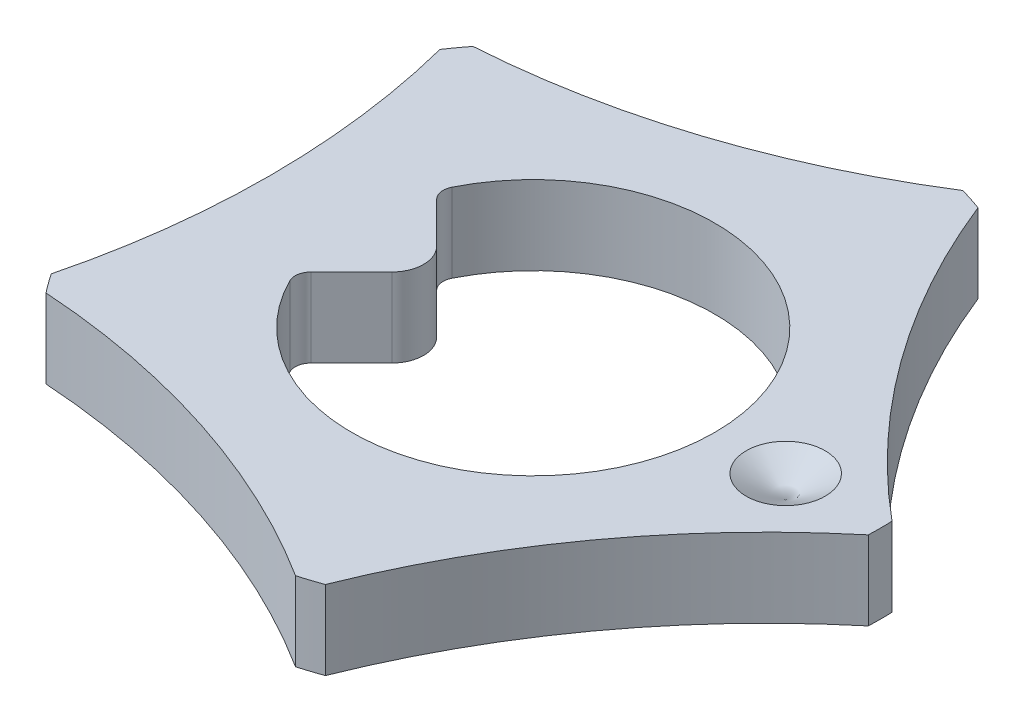
ISO-10303-21;
HEADER;
FILE_DESCRIPTION(('STEP AP214'),'2;1');
FILE_NAME('part.step','',(''),(''),'','','');
FILE_SCHEMA(('AUTOMOTIVE_DESIGN { 1 0 10303 214 1 1 1 1 }'));
ENDSEC;
DATA;
#1=APPLICATION_CONTEXT('core data for automotive mechanical design processes');
#2=APPLICATION_PROTOCOL_DEFINITION('international standard','automotive_design',2000,#1);
#3=PRODUCT_CONTEXT('',#1,'mechanical');
#4=PRODUCT('Part','Part','',(#3));
#5=PRODUCT_RELATED_PRODUCT_CATEGORY('part','',(#4));
#6=PRODUCT_DEFINITION_FORMATION('','',#4);
#7=PRODUCT_DEFINITION_CONTEXT('part definition',#1,'design');
#8=PRODUCT_DEFINITION('design','',#6,#7);
#9=PRODUCT_DEFINITION_SHAPE('','',#8);
#10=(LENGTH_UNIT() NAMED_UNIT(*) SI_UNIT(.MILLI.,.METRE.));
#11=(NAMED_UNIT(*) PLANE_ANGLE_UNIT() SI_UNIT($,.RADIAN.));
#12=(NAMED_UNIT(*) SI_UNIT($,.STERADIAN.) SOLID_ANGLE_UNIT());
#13=UNCERTAINTY_MEASURE_WITH_UNIT(LENGTH_MEASURE(1.E-05),#10,'distance_accuracy_value','');
#14=(GEOMETRIC_REPRESENTATION_CONTEXT(3) GLOBAL_UNCERTAINTY_ASSIGNED_CONTEXT((#13)) GLOBAL_UNIT_ASSIGNED_CONTEXT((#10,
#11,#12)) REPRESENTATION_CONTEXT('',''));
#15=CARTESIAN_POINT('',(0.,0.,0.));
#16=DIRECTION('',(0.,0.,1.));
#17=DIRECTION('',(1.,0.,0.));
#18=AXIS2_PLACEMENT_3D('',#15,#16,#17);
#19=CARTESIAN_POINT('',(0.,0.5,0.));
#20=DIRECTION('',(0.,-1.,0.));
#21=DIRECTION('',(0.,0.,-1.));
#22=AXIS2_PLACEMENT_3D('',#19,#20,#21);
#23=CYLINDRICAL_SURFACE('',#22,2.2);
#24=DIRECTION('',(0.,1.,0.));
#25=VECTOR('',#24,1.);
#26=CARTESIAN_POINT('',(0.750757798918163,0.,2.0679368286685));
#27=LINE('',#26,#25);
#28=CARTESIAN_POINT('',(0.750757798918164,0.,2.06793682866851));
#29=VERTEX_POINT('',#28);
#30=CARTESIAN_POINT('',(0.750757798918163,0.5,2.0679368286685));
#31=VERTEX_POINT('',#30);
#32=EDGE_CURVE('E308',#29,#31,#27,.T.);
#33=ORIENTED_EDGE('',*,*,#32,.T.);
#34=CARTESIAN_POINT('',(0.,0.5,0.));
#35=DIRECTION('',(0.,1.,0.));
#36=DIRECTION('',(0.,0.,1.));
#37=AXIS2_PLACEMENT_3D('',#34,#35,#36);
#38=CIRCLE('',#37,2.2);
#39=CARTESIAN_POINT('',(0.608126952579492,0.5,2.11428039993431));
#40=VERTEX_POINT('',#39);
#41=EDGE_CURVE('E227',#40,#31,#38,.T.);
#42=ORIENTED_EDGE('',*,*,#41,.F.);
#43=DIRECTION('',(0.,1.,0.));
#44=VECTOR('',#43,1.);
#45=CARTESIAN_POINT('',(0.608126952579492,0.,2.11428039993431));
#46=LINE('',#45,#44);
#47=CARTESIAN_POINT('',(0.608126952579492,0.,2.11428039993431));
#48=VERTEX_POINT('',#47);
#49=EDGE_CURVE('E310',#48,#40,#46,.T.);
#50=ORIENTED_EDGE('',*,*,#49,.F.);
#51=CARTESIAN_POINT('',(0.,0.,0.));
#52=DIRECTION('',(0.,1.,0.));
#53=DIRECTION('',(0.,0.,1.));
#54=AXIS2_PLACEMENT_3D('',#51,#52,#53);
#55=CIRCLE('',#54,2.2);
#56=EDGE_CURVE('E234',#48,#29,#55,.T.);
#57=ORIENTED_EDGE('',*,*,#56,.T.);
#58=EDGE_LOOP('',(#33,#42,#50,#57));
#59=FACE_BOUND('',#58,.T.);
#60=ADVANCED_FACE('F52',(#59),#23,.T.);
#61=DIRECTION('',(0.,1.,0.));
#62=VECTOR('',#61,1.);
#63=CARTESIAN_POINT('',(2.19872171471716,0.,0.0749854734681207));
#64=LINE('',#63,#62);
#65=CARTESIAN_POINT('',(2.19872171471716,0.,0.0749854734681207));
#66=VERTEX_POINT('',#65);
#67=CARTESIAN_POINT('',(2.19872171471716,0.5,0.0749854734681207));
#68=VERTEX_POINT('',#67);
#69=EDGE_CURVE('E306',#66,#68,#64,.T.);
#70=ORIENTED_EDGE('',*,*,#69,.F.);
#71=CARTESIAN_POINT('',(2.19872171471716,0.,-0.074985473468122));
#72=VERTEX_POINT('',#71);
#73=EDGE_CURVE('E237',#66,#72,#55,.T.);
#74=ORIENTED_EDGE('',*,*,#73,.T.);
#75=DIRECTION('',(0.,1.,0.));
#76=VECTOR('',#75,1.);
#77=CARTESIAN_POINT('',(2.19872171471716,0.,-0.0749854734681233));
#78=LINE('',#77,#76);
#79=CARTESIAN_POINT('',(2.19872171471716,0.5,-0.0749854734681233));
#80=VERTEX_POINT('',#79);
#81=EDGE_CURVE('E232',#72,#80,#78,.T.);
#82=ORIENTED_EDGE('',*,*,#81,.T.);
#83=EDGE_CURVE('E224',#68,#80,#38,.T.);
#84=ORIENTED_EDGE('',*,*,#83,.F.);
#85=EDGE_LOOP('',(#70,#74,#82,#84));
#86=FACE_BOUND('',#85,.T.);
#87=ADVANCED_FACE('F177',(#86),#23,.T.);
#88=DIRECTION('',(0.,1.,0.));
#89=VECTOR('',#88,1.);
#90=CARTESIAN_POINT('',(-1.73472787766668,0.,1.35304072017293));
#91=LINE('',#90,#89);
#92=CARTESIAN_POINT('',(-1.73472787766668,0.,1.35304072017293));
#93=VERTEX_POINT('',#92);
#94=CARTESIAN_POINT('',(-1.73472787766668,0.5,1.35304072017293));
#95=VERTEX_POINT('',#94);
#96=EDGE_CURVE('E312',#93,#95,#91,.T.);
#97=ORIENTED_EDGE('',*,*,#96,.T.);
#98=CARTESIAN_POINT('',(-1.82287858854814,0.5,1.231711675439));
#99=VERTEX_POINT('',#98);
#100=EDGE_CURVE('E228',#99,#95,#38,.T.);
#101=ORIENTED_EDGE('',*,*,#100,.F.);
#102=DIRECTION('',(0.,1.,0.));
#103=VECTOR('',#102,1.);
#104=CARTESIAN_POINT('',(-1.82287858854814,0.,1.231711675439));
#105=LINE('',#104,#103);
#106=CARTESIAN_POINT('',(-1.82287858854814,0.,1.231711675439));
#107=VERTEX_POINT('',#106);
#108=EDGE_CURVE('E315',#107,#99,#105,.T.);
#109=ORIENTED_EDGE('',*,*,#108,.F.);
#110=EDGE_CURVE('E238',#107,#93,#55,.T.);
#111=ORIENTED_EDGE('',*,*,#110,.T.);
#112=EDGE_LOOP('',(#97,#101,#109,#111));
#113=FACE_BOUND('',#112,.T.);
#114=ADVANCED_FACE('F184',(#113),#23,.T.);
#115=DIRECTION('',(0.,1.,0.));
#116=VECTOR('',#115,1.);
#117=CARTESIAN_POINT('',(-1.82287858854814,0.,-1.231711675439));
#118=LINE('',#117,#116);
#119=CARTESIAN_POINT('',(-1.82287858854814,0.,-1.231711675439));
#120=VERTEX_POINT('',#119);
#121=CARTESIAN_POINT('',(-1.82287858854814,0.5,-1.231711675439));
#122=VERTEX_POINT('',#121);
#123=EDGE_CURVE('E317',#120,#122,#118,.T.);
#124=ORIENTED_EDGE('',*,*,#123,.T.);
#125=CARTESIAN_POINT('',(-1.73472787766668,0.5,-1.35304072017293));
#126=VERTEX_POINT('',#125);
#127=EDGE_CURVE('E225',#126,#122,#38,.T.);
#128=ORIENTED_EDGE('',*,*,#127,.F.);
#129=DIRECTION('',(0.,1.,0.));
#130=VECTOR('',#129,1.);
#131=CARTESIAN_POINT('',(-1.73472787766668,0.,-1.35304072017293));
#132=LINE('',#131,#130);
#133=CARTESIAN_POINT('',(-1.73472787766668,0.,-1.35304072017293));
#134=VERTEX_POINT('',#133);
#135=EDGE_CURVE('E212',#134,#126,#132,.T.);
#136=ORIENTED_EDGE('',*,*,#135,.F.);
#137=EDGE_CURVE('E337',#134,#120,#55,.T.);
#138=ORIENTED_EDGE('',*,*,#137,.T.);
#139=EDGE_LOOP('',(#124,#128,#136,#138));
#140=FACE_BOUND('',#139,.T.);
#141=ADVANCED_FACE('F191',(#140),#23,.T.);
#142=DIRECTION('',(0.,1.,0.));
#143=VECTOR('',#142,1.);
#144=CARTESIAN_POINT('',(0.608126952579491,0.,-2.11428039993431));
#145=LINE('',#144,#143);
#146=CARTESIAN_POINT('',(0.608126952579491,0.,-2.11428039993431));
#147=VERTEX_POINT('',#146);
#148=CARTESIAN_POINT('',(0.608126952579491,0.5,-2.11428039993431));
#149=VERTEX_POINT('',#148);
#150=EDGE_CURVE('E204',#147,#149,#145,.T.);
#151=ORIENTED_EDGE('',*,*,#150,.T.);
#152=CARTESIAN_POINT('',(0.750757798918162,0.5,-2.06793682866851));
#153=VERTEX_POINT('',#152);
#154=EDGE_CURVE('E207',#153,#149,#38,.T.);
#155=ORIENTED_EDGE('',*,*,#154,.F.);
#156=DIRECTION('',(0.,1.,0.));
#157=VECTOR('',#156,1.);
#158=CARTESIAN_POINT('',(0.750757798918162,0.,-2.06793682866851));
#159=LINE('',#158,#157);
#160=CARTESIAN_POINT('',(0.750757798918162,0.,-2.06793682866851));
#161=VERTEX_POINT('',#160);
#162=EDGE_CURVE('E213',#161,#153,#159,.T.);
#163=ORIENTED_EDGE('',*,*,#162,.F.);
#164=EDGE_CURVE('E209',#161,#147,#55,.T.);
#165=ORIENTED_EDGE('',*,*,#164,.T.);
#166=EDGE_LOOP('',(#151,#155,#163,#165));
#167=FACE_BOUND('',#166,.T.);
#168=ADVANCED_FACE('F180',(#167),#23,.T.);
#169=CARTESIAN_POINT('',(0.,0.5,0.));
#170=DIRECTION('',(0.,1.,0.));
#171=DIRECTION('',(0.,0.,1.));
#172=AXIS2_PLACEMENT_3D('',#169,#170,#171);
#173=PLANE('',#172);
#174=CARTESIAN_POINT('',(1.6,0.5,0.));
#175=DIRECTION('',(0.,1.,0.));
#176=DIRECTION('',(0.,0.,1.));
#177=AXIS2_PLACEMENT_3D('',#174,#175,#176);
#178=CIRCLE('',#177,0.25);
#179=CARTESIAN_POINT('',(1.6,0.5,0.25));
#180=VERTEX_POINT('',#179);
#181=EDGE_CURVE('E513',#180,#180,#178,.T.);
#182=ORIENTED_EDGE('',*,*,#181,.F.);
#183=EDGE_LOOP('',(#182));
#184=FACE_BOUND('',#183,.T.);
#185=DIRECTION('',(-0.707106781186548,0.,0.707106781186547));
#186=VECTOR('',#185,1.);
#187=CARTESIAN_POINT('',(-0.612,0.5,0.));
#188=LINE('',#187,#186);
#189=CARTESIAN_POINT('',(-0.75342135623731,0.5,0.14142135623731));
#190=VERTEX_POINT('',#189);
#191=CARTESIAN_POINT('',(-1.01019381920649,0.5,0.398193819206485));
#192=VERTEX_POINT('',#191);
#193=EDGE_CURVE('E279',#190,#192,#188,.T.);
#194=ORIENTED_EDGE('',*,*,#193,.F.);
#195=CARTESIAN_POINT('',(-0.894842712474619,0.5,0.));
#196=DIRECTION('',(0.,1.,0.));
#197=DIRECTION('',(0.,0.,1.));
#198=AXIS2_PLACEMENT_3D('',#195,#196,#197);
#199=CIRCLE('',#198,0.2);
#200=CARTESIAN_POINT('',(-0.75342135623731,0.5,-0.14142135623731));
#201=VERTEX_POINT('',#200);
#202=EDGE_CURVE('E241',#190,#201,#199,.T.);
#203=ORIENTED_EDGE('',*,*,#202,.T.);
#204=DIRECTION('',(0.707106781186548,0.,0.707106781186547));
#205=VECTOR('',#204,1.);
#206=CARTESIAN_POINT('',(-1.05940161932398,0.5,-0.447401619323982));
#207=LINE('',#206,#205);
#208=CARTESIAN_POINT('',(-1.01019381920649,0.5,-0.398193819206485));
#209=VERTEX_POINT('',#208);
#210=EDGE_CURVE('E267',#209,#201,#207,.T.);
#211=ORIENTED_EDGE('',*,*,#210,.F.);
#212=CARTESIAN_POINT('',(-0.939483141087831,0.5,-0.46890449732514));
#213=DIRECTION('',(0.,1.,0.));
#214=DIRECTION('',(0.,0.,1.));
#215=AXIS2_PLACEMENT_3D('',#212,#213,#214);
#216=CIRCLE('',#215,0.1);
#217=CARTESIAN_POINT('',(-1.02895772595334,0.5,-0.513562068498963));
#218=VERTEX_POINT('',#217);
#219=EDGE_CURVE('E60',#209,#218,#216,.F.);
#220=ORIENTED_EDGE('',*,*,#219,.T.);
#221=CARTESIAN_POINT('',(0.,0.5,0.));
#222=DIRECTION('',(0.,1.,0.));
#223=DIRECTION('',(0.,0.,1.));
#224=AXIS2_PLACEMENT_3D('',#221,#222,#223);
#225=CIRCLE('',#224,1.15);
#226=CARTESIAN_POINT('',(-1.02895772595334,0.5,0.513562068498963));
#227=VERTEX_POINT('',#226);
#228=EDGE_CURVE('E266',#227,#218,#225,.T.);
#229=ORIENTED_EDGE('',*,*,#228,.F.);
#230=CARTESIAN_POINT('',(-0.93948314108783,0.5,0.46890449732514));
#231=DIRECTION('',(0.,1.,0.));
#232=DIRECTION('',(0.,0.,1.));
#233=AXIS2_PLACEMENT_3D('',#230,#231,#232);
#234=CIRCLE('',#233,0.1);
#235=EDGE_CURVE('E258',#227,#192,#234,.F.);
#236=ORIENTED_EDGE('',*,*,#235,.T.);
#237=EDGE_LOOP('',(#194,#203,#211,#220,#229,#236));
#238=FACE_BOUND('',#237,.T.);
#239=ORIENTED_EDGE('',*,*,#41,.T.);
#240=CARTESIAN_POINT('',(5.39516685773895,0.5,3.91981816783239));
#241=DIRECTION('',(0.,-1.,0.));
#242=DIRECTION('',(0.,0.,1.));
#243=AXIS2_PLACEMENT_3D('',#240,#241,#242);
#244=CIRCLE('',#243,5.);
#245=EDGE_CURVE('E289',#31,#68,#244,.T.);
#246=ORIENTED_EDGE('',*,*,#245,.T.);
#247=ORIENTED_EDGE('',*,*,#83,.T.);
#248=CARTESIAN_POINT('',(5.39516685773895,0.5,-3.91981816783239));
#249=DIRECTION('',(0.,-1.,0.));
#250=DIRECTION('',(0.,0.,1.));
#251=AXIS2_PLACEMENT_3D('',#248,#249,#250);
#252=CIRCLE('',#251,5.);
#253=EDGE_CURVE('E223',#80,#153,#252,.T.);
#254=ORIENTED_EDGE('',*,*,#253,.T.);
#255=ORIENTED_EDGE('',*,*,#154,.T.);
#256=CARTESIAN_POINT('',(-2.06077036467931,0.5,-6.34239902527215));
#257=DIRECTION('',(0.,-1.,0.));
#258=DIRECTION('',(0.,0.,1.));
#259=AXIS2_PLACEMENT_3D('',#256,#257,#258);
#260=CIRCLE('',#259,5.);
#261=EDGE_CURVE('E220',#149,#126,#260,.T.);
#262=ORIENTED_EDGE('',*,*,#261,.T.);
#263=ORIENTED_EDGE('',*,*,#127,.T.);
#264=CARTESIAN_POINT('',(-6.66879298611928,0.5,0.));
#265=DIRECTION('',(0.,-1.,0.));
#266=DIRECTION('',(0.,0.,1.));
#267=AXIS2_PLACEMENT_3D('',#264,#265,#266);
#268=CIRCLE('',#267,5.);
#269=EDGE_CURVE('E298',#122,#99,#268,.T.);
#270=ORIENTED_EDGE('',*,*,#269,.T.);
#271=ORIENTED_EDGE('',*,*,#100,.T.);
#272=CARTESIAN_POINT('',(-2.06077036467931,0.5,6.34239902527215));
#273=DIRECTION('',(0.,-1.,0.));
#274=DIRECTION('',(0.,0.,1.));
#275=AXIS2_PLACEMENT_3D('',#272,#273,#274);
#276=CIRCLE('',#275,5.);
#277=EDGE_CURVE('E301',#95,#40,#276,.T.);
#278=ORIENTED_EDGE('',*,*,#277,.T.);
#279=EDGE_LOOP('',(#239,#246,#247,#254,#255,#262,#263,#270,#271,#278));
#280=FACE_BOUND('',#279,.T.);
#281=ADVANCED_FACE('F190',(#184,#238,#280),#173,.T.);
#282=CARTESIAN_POINT('',(0.,0.,0.));
#283=DIRECTION('',(0.,1.,0.));
#284=DIRECTION('',(0.,0.,1.));
#285=AXIS2_PLACEMENT_3D('',#282,#283,#284);
#286=PLANE('',#285);
#287=DIRECTION('',(-0.707106781186548,0.,-0.707106781186547));
#288=VECTOR('',#287,1.);
#289=CARTESIAN_POINT('',(-1.05940161932398,0.,-0.447401619323982));
#290=LINE('',#289,#288);
#291=CARTESIAN_POINT('',(-0.75342135623731,0.,-0.14142135623731));
#292=VERTEX_POINT('',#291);
#293=CARTESIAN_POINT('',(-1.01019381920649,0.,-0.398193819206485));
#294=VERTEX_POINT('',#293);
#295=EDGE_CURVE('E276',#292,#294,#290,.T.);
#296=ORIENTED_EDGE('',*,*,#295,.F.);
#297=CARTESIAN_POINT('',(-0.894842712474619,0.,0.));
#298=DIRECTION('',(0.,1.,0.));
#299=DIRECTION('',(0.,0.,1.));
#300=AXIS2_PLACEMENT_3D('',#297,#298,#299);
#301=CIRCLE('',#300,0.2);
#302=CARTESIAN_POINT('',(-0.75342135623731,0.,0.14142135623731));
#303=VERTEX_POINT('',#302);
#304=EDGE_CURVE('E246',#292,#303,#301,.F.);
#305=ORIENTED_EDGE('',*,*,#304,.T.);
#306=DIRECTION('',(0.707106781186548,0.,-0.707106781186547));
#307=VECTOR('',#306,1.);
#308=CARTESIAN_POINT('',(-0.612,0.,0.));
#309=LINE('',#308,#307);
#310=CARTESIAN_POINT('',(-1.01019381920649,0.,0.398193819206485));
#311=VERTEX_POINT('',#310);
#312=EDGE_CURVE('E511',#311,#303,#309,.T.);
#313=ORIENTED_EDGE('',*,*,#312,.F.);
#314=CARTESIAN_POINT('',(-0.93948314108783,0.,0.46890449732514));
#315=DIRECTION('',(0.,1.,0.));
#316=DIRECTION('',(0.,0.,1.));
#317=AXIS2_PLACEMENT_3D('',#314,#315,#316);
#318=CIRCLE('',#317,0.1);
#319=CARTESIAN_POINT('',(-1.02895772595334,0.,0.513562068498963));
#320=VERTEX_POINT('',#319);
#321=EDGE_CURVE('E260',#311,#320,#318,.T.);
#322=ORIENTED_EDGE('',*,*,#321,.T.);
#323=CARTESIAN_POINT('',(0.,0.,0.));
#324=DIRECTION('',(0.,1.,0.));
#325=DIRECTION('',(0.,0.,1.));
#326=AXIS2_PLACEMENT_3D('',#323,#324,#325);
#327=CIRCLE('',#326,1.15);
#328=CARTESIAN_POINT('',(-1.02895772595334,0.,-0.513562068498963));
#329=VERTEX_POINT('',#328);
#330=EDGE_CURVE('E272',#329,#320,#327,.F.);
#331=ORIENTED_EDGE('',*,*,#330,.F.);
#332=CARTESIAN_POINT('',(-0.939483141087831,0.,-0.46890449732514));
#333=DIRECTION('',(0.,1.,0.));
#334=DIRECTION('',(0.,0.,1.));
#335=AXIS2_PLACEMENT_3D('',#332,#333,#334);
#336=CIRCLE('',#335,0.1);
#337=EDGE_CURVE('E14',#329,#294,#336,.T.);
#338=ORIENTED_EDGE('',*,*,#337,.T.);
#339=EDGE_LOOP('',(#296,#305,#313,#322,#331,#338));
#340=FACE_BOUND('',#339,.T.);
#341=CARTESIAN_POINT('',(5.39516685773895,0.,3.91981816783239));
#342=DIRECTION('',(0.,-1.,0.));
#343=DIRECTION('',(0.,0.,1.));
#344=AXIS2_PLACEMENT_3D('',#341,#342,#343);
#345=CIRCLE('',#344,5.);
#346=EDGE_CURVE('E295',#29,#66,#345,.T.);
#347=ORIENTED_EDGE('',*,*,#346,.F.);
#348=ORIENTED_EDGE('',*,*,#56,.F.);
#349=CARTESIAN_POINT('',(-2.06077036467931,0.,6.34239902527215));
#350=DIRECTION('',(0.,-1.,0.));
#351=DIRECTION('',(0.,0.,1.));
#352=AXIS2_PLACEMENT_3D('',#349,#350,#351);
#353=CIRCLE('',#352,5.);
#354=EDGE_CURVE('E293',#93,#48,#353,.T.);
#355=ORIENTED_EDGE('',*,*,#354,.F.);
#356=ORIENTED_EDGE('',*,*,#110,.F.);
#357=CARTESIAN_POINT('',(-6.66879298611928,0.,0.));
#358=DIRECTION('',(0.,-1.,0.));
#359=DIRECTION('',(0.,0.,1.));
#360=AXIS2_PLACEMENT_3D('',#357,#358,#359);
#361=CIRCLE('',#360,5.);
#362=EDGE_CURVE('E291',#120,#107,#361,.T.);
#363=ORIENTED_EDGE('',*,*,#362,.F.);
#364=ORIENTED_EDGE('',*,*,#137,.F.);
#365=CARTESIAN_POINT('',(-2.06077036467931,0.,-6.34239902527215));
#366=DIRECTION('',(0.,-1.,0.));
#367=DIRECTION('',(0.,0.,1.));
#368=AXIS2_PLACEMENT_3D('',#365,#366,#367);
#369=CIRCLE('',#368,5.);
#370=EDGE_CURVE('E288',#147,#134,#369,.T.);
#371=ORIENTED_EDGE('',*,*,#370,.F.);
#372=ORIENTED_EDGE('',*,*,#164,.F.);
#373=CARTESIAN_POINT('',(5.39516685773895,0.,-3.91981816783239));
#374=DIRECTION('',(0.,-1.,0.));
#375=DIRECTION('',(0.,0.,1.));
#376=AXIS2_PLACEMENT_3D('',#373,#374,#375);
#377=CIRCLE('',#376,5.);
#378=EDGE_CURVE('E286',#72,#161,#377,.T.);
#379=ORIENTED_EDGE('',*,*,#378,.F.);
#380=ORIENTED_EDGE('',*,*,#73,.F.);
#381=EDGE_LOOP('',(#347,#348,#355,#356,#363,#364,#371,#372,#379,#380));
#382=FACE_BOUND('',#381,.T.);
#383=ADVANCED_FACE('F197',(#340,#382),#286,.F.);
#384=CARTESIAN_POINT('',(5.39516685773895,0.,-3.91981816783239));
#385=DIRECTION('',(0.,1.,0.));
#386=DIRECTION('',(0.,0.,1.));
#387=AXIS2_PLACEMENT_3D('',#384,#385,#386);
#388=CYLINDRICAL_SURFACE('',#387,5.);
#389=ORIENTED_EDGE('',*,*,#253,.F.);
#390=ORIENTED_EDGE('',*,*,#81,.F.);
#391=ORIENTED_EDGE('',*,*,#378,.T.);
#392=ORIENTED_EDGE('',*,*,#162,.T.);
#393=EDGE_LOOP('',(#389,#390,#391,#392));
#394=FACE_BOUND('',#393,.T.);
#395=ADVANCED_FACE('F363',(#394),#388,.F.);
#396=CARTESIAN_POINT('',(-2.06077036467931,0.,-6.34239902527215));
#397=DIRECTION('',(0.,1.,0.));
#398=DIRECTION('',(0.,0.,1.));
#399=AXIS2_PLACEMENT_3D('',#396,#397,#398);
#400=CYLINDRICAL_SURFACE('',#399,5.);
#401=ORIENTED_EDGE('',*,*,#261,.F.);
#402=ORIENTED_EDGE('',*,*,#150,.F.);
#403=ORIENTED_EDGE('',*,*,#370,.T.);
#404=ORIENTED_EDGE('',*,*,#135,.T.);
#405=EDGE_LOOP('',(#401,#402,#403,#404));
#406=FACE_BOUND('',#405,.T.);
#407=ADVANCED_FACE('F357',(#406),#400,.F.);
#408=CARTESIAN_POINT('',(-6.66879298611928,0.,0.));
#409=DIRECTION('',(0.,1.,0.));
#410=DIRECTION('',(0.,0.,1.));
#411=AXIS2_PLACEMENT_3D('',#408,#409,#410);
#412=CYLINDRICAL_SURFACE('',#411,5.);
#413=ORIENTED_EDGE('',*,*,#269,.F.);
#414=ORIENTED_EDGE('',*,*,#123,.F.);
#415=ORIENTED_EDGE('',*,*,#362,.T.);
#416=ORIENTED_EDGE('',*,*,#108,.T.);
#417=EDGE_LOOP('',(#413,#414,#415,#416));
#418=FACE_BOUND('',#417,.T.);
#419=ADVANCED_FACE('F347',(#418),#412,.F.);
#420=CARTESIAN_POINT('',(-2.06077036467931,0.,6.34239902527215));
#421=DIRECTION('',(0.,1.,0.));
#422=DIRECTION('',(0.,0.,1.));
#423=AXIS2_PLACEMENT_3D('',#420,#421,#422);
#424=CYLINDRICAL_SURFACE('',#423,5.);
#425=ORIENTED_EDGE('',*,*,#277,.F.);
#426=ORIENTED_EDGE('',*,*,#96,.F.);
#427=ORIENTED_EDGE('',*,*,#354,.T.);
#428=ORIENTED_EDGE('',*,*,#49,.T.);
#429=EDGE_LOOP('',(#425,#426,#427,#428));
#430=FACE_BOUND('',#429,.T.);
#431=ADVANCED_FACE('F349',(#430),#424,.F.);
#432=CARTESIAN_POINT('',(5.39516685773895,0.,3.91981816783239));
#433=DIRECTION('',(0.,1.,0.));
#434=DIRECTION('',(0.,0.,1.));
#435=AXIS2_PLACEMENT_3D('',#432,#433,#434);
#436=CYLINDRICAL_SURFACE('',#435,5.);
#437=ORIENTED_EDGE('',*,*,#245,.F.);
#438=ORIENTED_EDGE('',*,*,#32,.F.);
#439=ORIENTED_EDGE('',*,*,#346,.T.);
#440=ORIENTED_EDGE('',*,*,#69,.T.);
#441=EDGE_LOOP('',(#437,#438,#439,#440));
#442=FACE_BOUND('',#441,.T.);
#443=ADVANCED_FACE('F329',(#442),#436,.F.);
#444=CARTESIAN_POINT('',(0.,-0.00100000000000002,0.));
#445=DIRECTION('',(0.,1.,0.));
#446=DIRECTION('',(0.,0.,1.));
#447=AXIS2_PLACEMENT_3D('',#444,#445,#446);
#448=CYLINDRICAL_SURFACE('',#447,1.15);
#449=ORIENTED_EDGE('',*,*,#330,.T.);
#450=DIRECTION('',(0.,1.,0.));
#451=VECTOR('',#450,1.);
#452=CARTESIAN_POINT('',(-1.02895772595334,-0.00100000000000002,0.513562068498963));
#453=LINE('',#452,#451);
#454=EDGE_CURVE('E251',#320,#227,#453,.T.);
#455=ORIENTED_EDGE('',*,*,#454,.T.);
#456=ORIENTED_EDGE('',*,*,#228,.T.);
#457=DIRECTION('',(0.,1.,0.));
#458=VECTOR('',#457,1.);
#459=CARTESIAN_POINT('',(-1.02895772595334,-0.00100000000000002,-0.513562068498963));
#460=LINE('',#459,#458);
#461=EDGE_CURVE('E249',#218,#329,#460,.F.);
#462=ORIENTED_EDGE('',*,*,#461,.T.);
#463=EDGE_LOOP('',(#449,#455,#456,#462));
#464=FACE_BOUND('',#463,.T.);
#465=ADVANCED_FACE('F270',(#464),#448,.F.);
#466=CARTESIAN_POINT('',(-0.612,-0.00100000000000002,0.));
#467=DIRECTION('',(-0.707106781186547,0.,-0.707106781186548));
#468=DIRECTION('',(-0.707106781186548,0.,0.707106781186547));
#469=AXIS2_PLACEMENT_3D('',#466,#467,#468);
#470=PLANE('',#469);
#471=ORIENTED_EDGE('',*,*,#193,.T.);
#472=DIRECTION('',(0.,-1.,0.));
#473=VECTOR('',#472,1.);
#474=CARTESIAN_POINT('',(-1.01019381920649,0.,0.398193819206485));
#475=LINE('',#474,#473);
#476=EDGE_CURVE('E254',#192,#311,#475,.T.);
#477=ORIENTED_EDGE('',*,*,#476,.T.);
#478=ORIENTED_EDGE('',*,*,#312,.T.);
#479=DIRECTION('',(0.,1.,0.));
#480=VECTOR('',#479,1.);
#481=CARTESIAN_POINT('',(-0.75342135623731,-0.00100000000000002,0.14142135623731));
#482=LINE('',#481,#480);
#483=EDGE_CURVE('E231',#303,#190,#482,.T.);
#484=ORIENTED_EDGE('',*,*,#483,.T.);
#485=EDGE_LOOP('',(#471,#477,#478,#484));
#486=FACE_BOUND('',#485,.T.);
#487=ADVANCED_FACE('F401',(#486),#470,.F.);
#488=CARTESIAN_POINT('',(-1.05940161932398,-0.00100000000000002,-0.447401619323982));
#489=DIRECTION('',(-0.707106781186547,0.,0.707106781186548));
#490=DIRECTION('',(0.707106781186548,0.,0.707106781186547));
#491=AXIS2_PLACEMENT_3D('',#488,#489,#490);
#492=PLANE('',#491);
#493=ORIENTED_EDGE('',*,*,#295,.T.);
#494=DIRECTION('',(0.,-1.,0.));
#495=VECTOR('',#494,1.);
#496=CARTESIAN_POINT('',(-1.01019381920649,0.5,-0.398193819206485));
#497=LINE('',#496,#495);
#498=EDGE_CURVE('E256',#294,#209,#497,.F.);
#499=ORIENTED_EDGE('',*,*,#498,.T.);
#500=ORIENTED_EDGE('',*,*,#210,.T.);
#501=DIRECTION('',(0.,1.,0.));
#502=VECTOR('',#501,1.);
#503=CARTESIAN_POINT('',(-0.75342135623731,-0.00100000000000002,-0.14142135623731));
#504=LINE('',#503,#502);
#505=EDGE_CURVE('E244',#201,#292,#504,.F.);
#506=ORIENTED_EDGE('',*,*,#505,.T.);
#507=EDGE_LOOP('',(#493,#499,#500,#506));
#508=FACE_BOUND('',#507,.T.);
#509=ADVANCED_FACE('F275',(#508),#492,.F.);
#510=CARTESIAN_POINT('',(-0.894842712474619,-0.00100000000000002,0.));
#511=DIRECTION('',(0.,1.,0.));
#512=DIRECTION('',(0.,0.,1.));
#513=AXIS2_PLACEMENT_3D('',#510,#511,#512);
#514=CYLINDRICAL_SURFACE('',#513,0.2);
#515=ORIENTED_EDGE('',*,*,#304,.F.);
#516=ORIENTED_EDGE('',*,*,#505,.F.);
#517=ORIENTED_EDGE('',*,*,#202,.F.);
#518=ORIENTED_EDGE('',*,*,#483,.F.);
#519=EDGE_LOOP('',(#515,#516,#517,#518));
#520=FACE_BOUND('',#519,.T.);
#521=ADVANCED_FACE('F413',(#520),#514,.T.);
#522=CARTESIAN_POINT('',(-0.93948314108783,-0.00100000000000002,0.46890449732514));
#523=DIRECTION('',(0.,1.,0.));
#524=DIRECTION('',(0.,0.,1.));
#525=AXIS2_PLACEMENT_3D('',#522,#523,#524);
#526=CYLINDRICAL_SURFACE('',#525,0.1);
#527=ORIENTED_EDGE('',*,*,#321,.F.);
#528=ORIENTED_EDGE('',*,*,#476,.F.);
#529=ORIENTED_EDGE('',*,*,#235,.F.);
#530=ORIENTED_EDGE('',*,*,#454,.F.);
#531=EDGE_LOOP('',(#527,#528,#529,#530));
#532=FACE_BOUND('',#531,.T.);
#533=ADVANCED_FACE('F173',(#532),#526,.F.);
#534=CARTESIAN_POINT('',(-0.939483141087831,-0.00100000000000002,-0.46890449732514));
#535=DIRECTION('',(0.,1.,0.));
#536=DIRECTION('',(0.,0.,1.));
#537=AXIS2_PLACEMENT_3D('',#534,#535,#536);
#538=CYLINDRICAL_SURFACE('',#537,0.1);
#539=ORIENTED_EDGE('',*,*,#337,.F.);
#540=ORIENTED_EDGE('',*,*,#461,.F.);
#541=ORIENTED_EDGE('',*,*,#219,.F.);
#542=ORIENTED_EDGE('',*,*,#498,.F.);
#543=EDGE_LOOP('',(#539,#540,#541,#542));
#544=FACE_BOUND('',#543,.T.);
#545=ADVANCED_FACE('F54',(#544),#538,.F.);
#546=CARTESIAN_POINT('',(1.6,0.355662432702592,0.));
#547=DIRECTION('',(0.,1.,0.));
#548=DIRECTION('',(0.,0.,1.));
#549=AXIS2_PLACEMENT_3D('',#546,#547,#548);
#550=CONICAL_SURFACE('',#549,0.,1.04719755119659);
#551=ORIENTED_EDGE('',*,*,#181,.T.);
#552=EDGE_LOOP('',(#551));
#553=FACE_BOUND('',#552,.T.);
#554=CARTESIAN_POINT('',(1.6,0.355662432702592,0.));
#555=VERTEX_POINT('',#554);
#556=VERTEX_LOOP('',#555);
#557=FACE_BOUND('',#556,.T.);
#558=ADVANCED_FACE('F166',(#553,#557),#550,.F.);
#559=CLOSED_SHELL('',(#60,#87,#114,#141,#168,#281,#383,#395,#407,#419,#431,#443,#465,#487,#509,
#521,#533,#545,#558));
#560=MANIFOLD_SOLID_BREP('B2',#559);
#561=ADVANCED_BREP_SHAPE_REPRESENTATION('',(#18,#560),#14);
#562=SHAPE_DEFINITION_REPRESENTATION(#9,#561);
ENDSEC;
END-ISO-10303-21;
